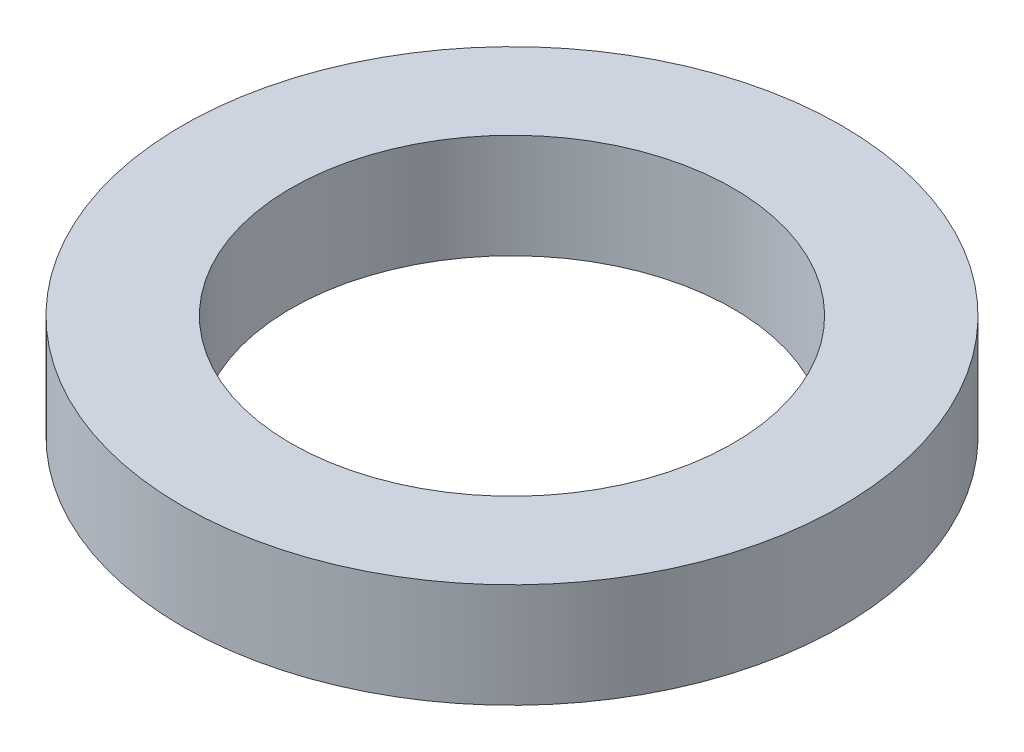
ISO-10303-21;
HEADER;
FILE_DESCRIPTION(('STEP AP214'),'2;1');
FILE_NAME('part.step','',(''),(''),'','','');
FILE_SCHEMA(('AUTOMOTIVE_DESIGN { 1 0 10303 214 1 1 1 1 }'));
ENDSEC;
DATA;
#1=APPLICATION_CONTEXT('core data for automotive mechanical design processes');
#2=APPLICATION_PROTOCOL_DEFINITION('international standard','automotive_design',2000,#1);
#3=PRODUCT_CONTEXT('',#1,'mechanical');
#4=PRODUCT('Part','Part','',(#3));
#5=PRODUCT_RELATED_PRODUCT_CATEGORY('part','',(#4));
#6=PRODUCT_DEFINITION_FORMATION('','',#4);
#7=PRODUCT_DEFINITION_CONTEXT('part definition',#1,'design');
#8=PRODUCT_DEFINITION('design','',#6,#7);
#9=PRODUCT_DEFINITION_SHAPE('','',#8);
#10=(LENGTH_UNIT() NAMED_UNIT(*) SI_UNIT(.MILLI.,.METRE.));
#11=(NAMED_UNIT(*) PLANE_ANGLE_UNIT() SI_UNIT($,.RADIAN.));
#12=(NAMED_UNIT(*) SI_UNIT($,.STERADIAN.) SOLID_ANGLE_UNIT());
#13=UNCERTAINTY_MEASURE_WITH_UNIT(LENGTH_MEASURE(1.E-05),#10,'distance_accuracy_value','');
#14=(GEOMETRIC_REPRESENTATION_CONTEXT(3) GLOBAL_UNCERTAINTY_ASSIGNED_CONTEXT((#13)) GLOBAL_UNIT_ASSIGNED_CONTEXT((#10,
#11,#12)) REPRESENTATION_CONTEXT('',''));
#15=CARTESIAN_POINT('',(0.,0.,0.));
#16=DIRECTION('',(0.,0.,1.));
#17=DIRECTION('',(1.,0.,0.));
#18=AXIS2_PLACEMENT_3D('',#15,#16,#17);
#19=CARTESIAN_POINT('',(0.,0.95,0.));
#20=DIRECTION('',(0.,1.,0.));
#21=DIRECTION('',(0.,0.,1.));
#22=AXIS2_PLACEMENT_3D('',#19,#20,#21);
#23=PLANE('',#22);
#24=CARTESIAN_POINT('',(0.,0.95,0.));
#25=DIRECTION('',(0.,1.,0.));
#26=DIRECTION('',(0.,0.,1.));
#27=AXIS2_PLACEMENT_3D('',#24,#25,#26);
#28=CIRCLE('',#27,6.);
#29=CARTESIAN_POINT('',(0.,0.95,6.));
#30=VERTEX_POINT('',#29);
#31=EDGE_CURVE('E10',#30,#30,#28,.T.);
#32=ORIENTED_EDGE('',*,*,#31,.T.);
#33=EDGE_LOOP('',(#32));
#34=FACE_BOUND('',#33,.T.);
#35=CARTESIAN_POINT('',(0.,0.95,0.));
#36=DIRECTION('',(0.,1.,0.));
#37=DIRECTION('',(0.,0.,1.));
#38=AXIS2_PLACEMENT_3D('',#35,#36,#37);
#39=CIRCLE('',#38,4.025);
#40=CARTESIAN_POINT('',(0.,0.95,4.025));
#41=VERTEX_POINT('',#40);
#42=EDGE_CURVE('E42',#41,#41,#39,.T.);
#43=ORIENTED_EDGE('',*,*,#42,.F.);
#44=EDGE_LOOP('',(#43));
#45=FACE_BOUND('',#44,.T.);
#46=ADVANCED_FACE('F31',(#34,#45),#23,.T.);
#47=CARTESIAN_POINT('',(0.,-0.95,0.));
#48=DIRECTION('',(0.,1.,0.));
#49=DIRECTION('',(0.,0.,1.));
#50=AXIS2_PLACEMENT_3D('',#47,#48,#49);
#51=PLANE('',#50);
#52=CARTESIAN_POINT('',(0.,-0.95,0.));
#53=DIRECTION('',(0.,1.,0.));
#54=DIRECTION('',(0.,0.,1.));
#55=AXIS2_PLACEMENT_3D('',#52,#53,#54);
#56=CIRCLE('',#55,6.);
#57=CARTESIAN_POINT('',(0.,-0.95,6.));
#58=VERTEX_POINT('',#57);
#59=EDGE_CURVE('E35',#58,#58,#56,.T.);
#60=ORIENTED_EDGE('',*,*,#59,.F.);
#61=EDGE_LOOP('',(#60));
#62=FACE_BOUND('',#61,.T.);
#63=CARTESIAN_POINT('',(0.,-0.95,0.));
#64=DIRECTION('',(0.,1.,0.));
#65=DIRECTION('',(0.,0.,1.));
#66=AXIS2_PLACEMENT_3D('',#63,#64,#65);
#67=CIRCLE('',#66,4.025);
#68=CARTESIAN_POINT('',(0.,-0.95,4.025));
#69=VERTEX_POINT('',#68);
#70=EDGE_CURVE('E44',#69,#69,#67,.T.);
#71=ORIENTED_EDGE('',*,*,#70,.T.);
#72=EDGE_LOOP('',(#71));
#73=FACE_BOUND('',#72,.T.);
#74=ADVANCED_FACE('F54',(#62,#73),#51,.F.);
#75=CARTESIAN_POINT('',(0.,0.95,0.));
#76=DIRECTION('',(0.,-1.,0.));
#77=DIRECTION('',(0.,0.,-1.));
#78=AXIS2_PLACEMENT_3D('',#75,#76,#77);
#79=CYLINDRICAL_SURFACE('',#78,6.);
#80=ORIENTED_EDGE('',*,*,#31,.F.);
#81=EDGE_LOOP('',(#80));
#82=FACE_BOUND('',#81,.T.);
#83=ORIENTED_EDGE('',*,*,#59,.T.);
#84=EDGE_LOOP('',(#83));
#85=FACE_BOUND('',#84,.T.);
#86=ADVANCED_FACE('F33',(#82,#85),#79,.T.);
#87=CARTESIAN_POINT('',(0.,0.95,0.));
#88=DIRECTION('',(0.,-1.,0.));
#89=DIRECTION('',(0.,0.,-1.));
#90=AXIS2_PLACEMENT_3D('',#87,#88,#89);
#91=CYLINDRICAL_SURFACE('',#90,4.025);
#92=ORIENTED_EDGE('',*,*,#42,.T.);
#93=EDGE_LOOP('',(#92));
#94=FACE_BOUND('',#93,.T.);
#95=ORIENTED_EDGE('',*,*,#70,.F.);
#96=EDGE_LOOP('',(#95));
#97=FACE_BOUND('',#96,.T.);
#98=ADVANCED_FACE('F50',(#94,#97),#91,.F.);
#99=CLOSED_SHELL('',(#46,#74,#86,#98));
#100=MANIFOLD_SOLID_BREP('B2',#99);
#101=ADVANCED_BREP_SHAPE_REPRESENTATION('',(#18,#100),#14);
#102=SHAPE_DEFINITION_REPRESENTATION(#9,#101);
ENDSEC;
END-ISO-10303-21;
